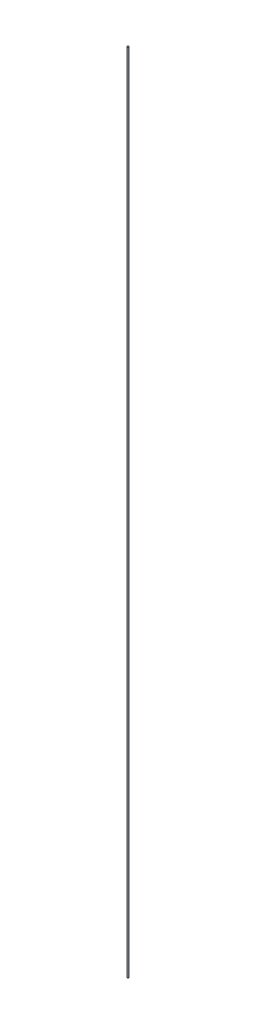
ISO-10303-21;
HEADER;
FILE_DESCRIPTION(('STEP AP214'),'2;1');
FILE_NAME('part.step','',(''),(''),'','','');
FILE_SCHEMA(('AUTOMOTIVE_DESIGN { 1 0 10303 214 1 1 1 1 }'));
ENDSEC;
DATA;
#1=APPLICATION_CONTEXT('core data for automotive mechanical design processes');
#2=APPLICATION_PROTOCOL_DEFINITION('international standard','automotive_design',2000,#1);
#3=PRODUCT_CONTEXT('',#1,'mechanical');
#4=PRODUCT('Part','Part','',(#3));
#5=PRODUCT_RELATED_PRODUCT_CATEGORY('part','',(#4));
#6=PRODUCT_DEFINITION_FORMATION('','',#4);
#7=PRODUCT_DEFINITION_CONTEXT('part definition',#1,'design');
#8=PRODUCT_DEFINITION('design','',#6,#7);
#9=PRODUCT_DEFINITION_SHAPE('','',#8);
#10=(LENGTH_UNIT() NAMED_UNIT(*) SI_UNIT(.MILLI.,.METRE.));
#11=(NAMED_UNIT(*) PLANE_ANGLE_UNIT() SI_UNIT($,.RADIAN.));
#12=(NAMED_UNIT(*) SI_UNIT($,.STERADIAN.) SOLID_ANGLE_UNIT());
#13=UNCERTAINTY_MEASURE_WITH_UNIT(LENGTH_MEASURE(1.E-05),#10,'distance_accuracy_value','');
#14=(GEOMETRIC_REPRESENTATION_CONTEXT(3) GLOBAL_UNCERTAINTY_ASSIGNED_CONTEXT((#13)) GLOBAL_UNIT_ASSIGNED_CONTEXT((#10,
#11,#12)) REPRESENTATION_CONTEXT('',''));
#15=CARTESIAN_POINT('',(0.,0.,0.));
#16=DIRECTION('',(0.,0.,1.));
#17=DIRECTION('',(1.,0.,0.));
#18=AXIS2_PLACEMENT_3D('',#15,#16,#17);
#19=CARTESIAN_POINT('',(0.,1282.7,0.));
#20=DIRECTION('',(0.,-1.,0.));
#21=DIRECTION('',(0.,0.,-1.));
#22=AXIS2_PLACEMENT_3D('',#19,#20,#21);
#23=CYLINDRICAL_SURFACE('',#22,1.27);
#24=CARTESIAN_POINT('',(0.,1282.7,0.));
#25=DIRECTION('',(0.,1.,0.));
#26=DIRECTION('',(0.,0.,1.));
#27=AXIS2_PLACEMENT_3D('',#24,#25,#26);
#28=CIRCLE('',#27,1.27);
#29=CARTESIAN_POINT('',(0.,1282.7,1.27));
#30=VERTEX_POINT('',#29);
#31=EDGE_CURVE('E10',#30,#30,#28,.T.);
#32=ORIENTED_EDGE('',*,*,#31,.F.);
#33=EDGE_LOOP('',(#32));
#34=FACE_BOUND('',#33,.T.);
#35=CARTESIAN_POINT('',(0.,0.,0.));
#36=DIRECTION('',(0.,1.,0.));
#37=DIRECTION('',(0.,0.,1.));
#38=AXIS2_PLACEMENT_3D('',#35,#36,#37);
#39=CIRCLE('',#38,1.27);
#40=CARTESIAN_POINT('',(0.,0.,1.27));
#41=VERTEX_POINT('',#40);
#42=EDGE_CURVE('E33',#41,#41,#39,.T.);
#43=ORIENTED_EDGE('',*,*,#42,.T.);
#44=EDGE_LOOP('',(#43));
#45=FACE_BOUND('',#44,.T.);
#46=ADVANCED_FACE('F30',(#34,#45),#23,.T.);
#47=CARTESIAN_POINT('',(0.,1282.7,0.));
#48=DIRECTION('',(0.,1.,0.));
#49=DIRECTION('',(0.,0.,1.));
#50=AXIS2_PLACEMENT_3D('',#47,#48,#49);
#51=PLANE('',#50);
#52=ORIENTED_EDGE('',*,*,#31,.T.);
#53=EDGE_LOOP('',(#52));
#54=FACE_BOUND('',#53,.T.);
#55=ADVANCED_FACE('F45',(#54),#51,.T.);
#56=CARTESIAN_POINT('',(0.,0.,0.));
#57=DIRECTION('',(0.,1.,0.));
#58=DIRECTION('',(0.,0.,1.));
#59=AXIS2_PLACEMENT_3D('',#56,#57,#58);
#60=PLANE('',#59);
#61=ORIENTED_EDGE('',*,*,#42,.F.);
#62=EDGE_LOOP('',(#61));
#63=FACE_BOUND('',#62,.T.);
#64=ADVANCED_FACE('F43',(#63),#60,.F.);
#65=CLOSED_SHELL('',(#46,#55,#64));
#66=MANIFOLD_SOLID_BREP('B2',#65);
#67=ADVANCED_BREP_SHAPE_REPRESENTATION('',(#18,#66),#14);
#68=SHAPE_DEFINITION_REPRESENTATION(#9,#67);
ENDSEC;
END-ISO-10303-21;
